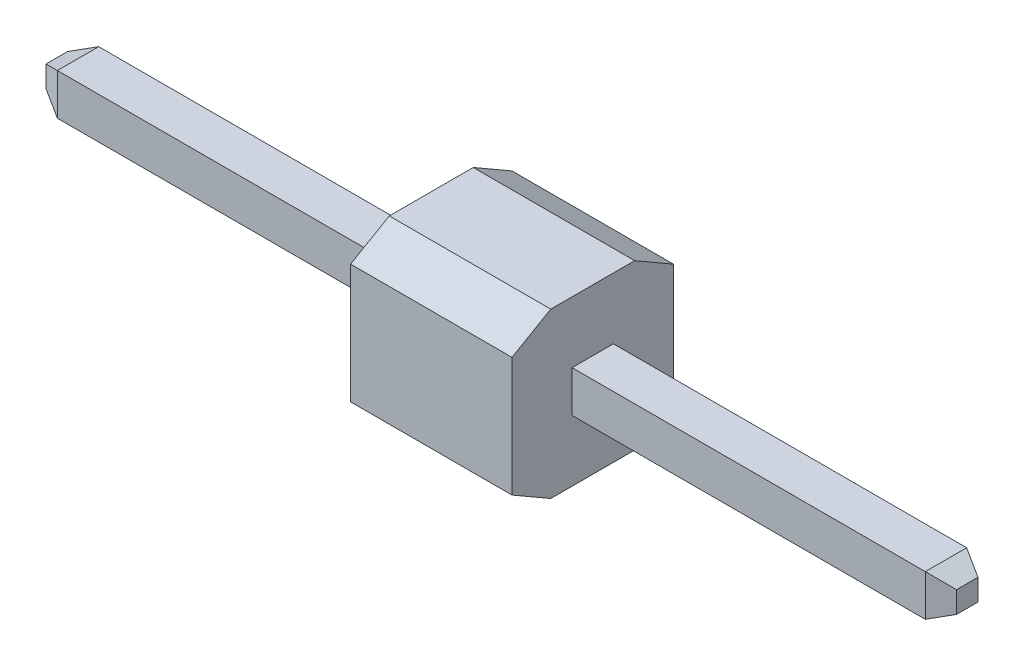
ISO-10303-21;
HEADER;
FILE_DESCRIPTION(('STEP AP214'),'2;1');
FILE_NAME('part.step','',(''),(''),'','','');
FILE_SCHEMA(('AUTOMOTIVE_DESIGN { 1 0 10303 214 1 1 1 1 }'));
ENDSEC;
DATA;
#1=APPLICATION_CONTEXT('core data for automotive mechanical design processes');
#2=APPLICATION_PROTOCOL_DEFINITION('international standard','automotive_design',2000,#1);
#3=PRODUCT_CONTEXT('',#1,'mechanical');
#4=PRODUCT('Part','Part','',(#3));
#5=PRODUCT_RELATED_PRODUCT_CATEGORY('part','',(#4));
#6=PRODUCT_DEFINITION_FORMATION('','',#4);
#7=PRODUCT_DEFINITION_CONTEXT('part definition',#1,'design');
#8=PRODUCT_DEFINITION('design','',#6,#7);
#9=PRODUCT_DEFINITION_SHAPE('','',#8);
#10=(LENGTH_UNIT() NAMED_UNIT(*) SI_UNIT(.MILLI.,.METRE.));
#11=(NAMED_UNIT(*) PLANE_ANGLE_UNIT() SI_UNIT($,.RADIAN.));
#12=(NAMED_UNIT(*) SI_UNIT($,.STERADIAN.) SOLID_ANGLE_UNIT());
#13=UNCERTAINTY_MEASURE_WITH_UNIT(LENGTH_MEASURE(1.E-05),#10,'distance_accuracy_value','');
#14=(GEOMETRIC_REPRESENTATION_CONTEXT(3) GLOBAL_UNCERTAINTY_ASSIGNED_CONTEXT((#13)) GLOBAL_UNIT_ASSIGNED_CONTEXT((#10,
#11,#12)) REPRESENTATION_CONTEXT('',''));
#15=CARTESIAN_POINT('',(0.,0.,0.));
#16=DIRECTION('',(0.,0.,1.));
#17=DIRECTION('',(1.,0.,0.));
#18=AXIS2_PLACEMENT_3D('',#15,#16,#17);
#19=CARTESIAN_POINT('',(5.42104959487915,-12.382878551897,-2.6299971441395));
#20=DIRECTION('',(1.,-9.93476518829084E-08,4.37113882867379E-08));
#21=DIRECTION('',(-9.93476589883358E-08,-1.,8.74227765734759E-08));
#22=AXIS2_PLACEMENT_3D('',#19,#20,#21);
#23=PLANE('',#22);
#24=DIRECTION('',(-1.18186632778994E-08,-0.500000075710538,-0.866025360072935));
#25=VECTOR('',#24,1.);
#26=CARTESIAN_POINT('',(5.42104940270454,-13.6264682531292,-1.05999703542142));
#27=LINE('',#26,#25);
#28=CARTESIAN_POINT('',(5.42104940270454,-13.6264682531292,-1.05999703542142));
#29=VERTEX_POINT('',#28);
#30=CARTESIAN_POINT('',(5.42104939451633,-13.9728784670969,-1.65999700513728));
#31=VERTEX_POINT('',#30);
#32=EDGE_CURVE('E11',#29,#31,#27,.T.);
#33=ORIENTED_EDGE('',*,*,#32,.T.);
#34=DIRECTION('',(4.37113811813104E-08,-8.74227828590458E-08,-0.999999999999995));
#35=VECTOR('',#34,1.);
#36=CARTESIAN_POINT('',(5.42104939451633,-13.9728784670969,-1.65999700513728));
#37=LINE('',#36,#35);
#38=CARTESIAN_POINT('',(5.42104945134113,-13.9728785807465,-2.95999700513728));
#39=VERTEX_POINT('',#38);
#40=EDGE_CURVE('E304',#31,#39,#37,.T.);
#41=ORIENTED_EDGE('',*,*,#40,.T.);
#42=DIRECTION('',(8.75289963529269E-08,0.499999924289835,-0.866025447495714));
#43=VECTOR('',#42,1.);
#44=CARTESIAN_POINT('',(5.42104945134113,-13.9728785807465,-2.95999700513728));
#45=LINE('',#44,#43);
#46=CARTESIAN_POINT('',(5.421049511983,-13.6264684716862,-3.55999703542142));
#47=VERTEX_POINT('',#46);
#48=EDGE_CURVE('E296',#39,#47,#45,.T.);
#49=ORIENTED_EDGE('',*,*,#48,.T.);
#50=DIRECTION('',(9.93476593243698E-08,0.999999999999991,-8.74227764821842E-08));
#51=VECTOR('',#50,1.);
#52=CARTESIAN_POINT('',(5.421049511983,-13.6264684716862,-3.55999703542142));
#53=LINE('',#52,#51);
#54=CARTESIAN_POINT('',(5.42104969549597,-11.7792887947141,-3.559997196907));
#55=VERTEX_POINT('',#54);
#56=EDGE_CURVE('E281',#47,#55,#53,.T.);
#57=ORIENTED_EDGE('',*,*,#56,.T.);
#58=DIRECTION('',(-1.18186632778994E-08,-0.500000075710538,-0.866025360072935));
#59=VECTOR('',#58,1.);
#60=CARTESIAN_POINT('',(5.42104970368418,-11.4328785807465,-2.95999722719114));
#61=LINE('',#60,#59);
#62=CARTESIAN_POINT('',(5.42104970368418,-11.4328785807465,-2.95999722719114));
#63=VERTEX_POINT('',#62);
#64=EDGE_CURVE('E265',#63,#55,#61,.T.);
#65=ORIENTED_EDGE('',*,*,#64,.F.);
#66=DIRECTION('',(4.37113811813104E-08,-8.74227842254741E-08,-0.999999999999995));
#67=VECTOR('',#66,1.);
#68=CARTESIAN_POINT('',(5.42104964685939,-11.4328784670969,-1.65999722719114));
#69=LINE('',#68,#67);
#70=CARTESIAN_POINT('',(5.42104964685939,-11.4328784670969,-1.65999722719114));
#71=VERTEX_POINT('',#70);
#72=EDGE_CURVE('E248',#71,#63,#69,.T.);
#73=ORIENTED_EDGE('',*,*,#72,.F.);
#74=DIRECTION('',(8.75289963529269E-08,0.499999924289835,-0.866025447495714));
#75=VECTOR('',#74,1.);
#76=CARTESIAN_POINT('',(5.42104958621752,-11.7792885761572,-1.059997196907));
#77=LINE('',#76,#75);
#78=CARTESIAN_POINT('',(5.42104958621752,-11.7792885761572,-1.059997196907));
#79=VERTEX_POINT('',#78);
#80=EDGE_CURVE('E242',#79,#71,#77,.T.);
#81=ORIENTED_EDGE('',*,*,#80,.F.);
#82=DIRECTION('',(9.93476593243698E-08,0.999999999999991,-8.74227762417695E-08));
#83=VECTOR('',#82,1.);
#84=CARTESIAN_POINT('',(5.42104940270454,-13.6264682531292,-1.05999703542142));
#85=LINE('',#84,#83);
#86=EDGE_CURVE('E236',#29,#79,#85,.T.);
#87=ORIENTED_EDGE('',*,*,#86,.F.);
#88=EDGE_LOOP('',(#33,#41,#49,#57,#65,#73,#81,#87));
#89=FACE_BOUND('',#88,.T.);
#90=DIRECTION('',(-4.37113803486431E-08,8.74227856773042E-08,0.999999999999995));
#91=VECTOR('',#90,1.);
#92=CARTESIAN_POINT('',(5.42104953129665,-13.022878551897,-2.62999708818892));
#93=LINE('',#92,#91);
#94=CARTESIAN_POINT('',(5.42104953129665,-13.022878551897,-2.62999708818892));
#95=VERTEX_POINT('',#94);
#96=CARTESIAN_POINT('',(5.42104950332137,-13.0228784959464,-1.98999708818892));
#97=VERTEX_POINT('',#96);
#98=EDGE_CURVE('E302',#95,#97,#93,.T.);
#99=ORIENTED_EDGE('',*,*,#98,.T.);
#100=DIRECTION('',(-9.93476578781121E-08,-0.999999999999991,8.7422776656742E-08));
#101=VECTOR('',#100,1.);
#102=CARTESIAN_POINT('',(5.42104956690387,-12.3828784959464,-1.9899971441395));
#103=LINE('',#102,#101);
#104=CARTESIAN_POINT('',(5.42104956690387,-12.3828784959464,-1.9899971441395));
#105=VERTEX_POINT('',#104);
#106=EDGE_CURVE('E293',#105,#97,#103,.T.);
#107=ORIENTED_EDGE('',*,*,#106,.F.);
#108=DIRECTION('',(-4.37113817364219E-08,8.74227829017466E-08,0.999999999999995));
#109=VECTOR('',#108,1.);
#110=CARTESIAN_POINT('',(5.42104959487915,-12.382878551897,-2.6299971441395));
#111=LINE('',#110,#109);
#112=CARTESIAN_POINT('',(5.42104959487915,-12.382878551897,-2.6299971441395));
#113=VERTEX_POINT('',#112);
#114=EDGE_CURVE('E278',#113,#105,#111,.T.);
#115=ORIENTED_EDGE('',*,*,#114,.F.);
#116=DIRECTION('',(-9.93476592658906E-08,-0.999999999999991,8.74227766567418E-08));
#117=VECTOR('',#116,1.);
#118=CARTESIAN_POINT('',(5.42104959487915,-12.382878551897,-2.6299971441395));
#119=LINE('',#118,#117);
#120=EDGE_CURVE('E263',#113,#95,#119,.T.);
#121=ORIENTED_EDGE('',*,*,#120,.T.);
#122=EDGE_LOOP('',(#99,#107,#115,#121));
#123=FACE_BOUND('',#122,.T.);
#124=ADVANCED_FACE('F17',(#89,#123),#23,.T.);
#125=CARTESIAN_POINT('',(2.92104959487915,-12.3828783035278,-2.62999725341797));
#126=DIRECTION('',(1.,-9.93476518829084E-08,4.37113882867379E-08));
#127=DIRECTION('',(-9.93476589883358E-08,-1.,8.74227765734759E-08));
#128=AXIS2_PLACEMENT_3D('',#125,#126,#127);
#129=PLANE('',#128);
#130=DIRECTION('',(-1.18186626369119E-08,-0.500000075710538,-0.866025360072935));
#131=VECTOR('',#130,1.);
#132=CARTESIAN_POINT('',(2.92104940270454,-13.6264680047601,-1.05999714469989));
#133=LINE('',#132,#131);
#134=CARTESIAN_POINT('',(2.92104940270454,-13.6264680047601,-1.05999714469989));
#135=VERTEX_POINT('',#134);
#136=CARTESIAN_POINT('',(2.92104939451633,-13.9728782187277,-1.65999711441575));
#137=VERTEX_POINT('',#136);
#138=EDGE_CURVE('E24',#135,#137,#133,.T.);
#139=ORIENTED_EDGE('',*,*,#138,.F.);
#140=DIRECTION('',(9.9347659083955E-08,0.999999999999991,-8.74227762417695E-08));
#141=VECTOR('',#140,1.);
#142=CARTESIAN_POINT('',(2.92104940270454,-13.6264680047601,-1.05999714469989));
#143=LINE('',#142,#141);
#144=CARTESIAN_POINT('',(2.92104958621752,-11.7792883277881,-1.05999730618547));
#145=VERTEX_POINT('',#144);
#146=EDGE_CURVE('E300',#135,#145,#143,.T.);
#147=ORIENTED_EDGE('',*,*,#146,.T.);
#148=DIRECTION('',(8.75289957119393E-08,0.499999924289835,-0.866025447495714));
#149=VECTOR('',#148,1.);
#150=CARTESIAN_POINT('',(2.92104958621752,-11.7792883277881,-1.05999730618547));
#151=LINE('',#150,#149);
#152=CARTESIAN_POINT('',(2.92104964685939,-11.4328782187277,-1.65999733646961));
#153=VERTEX_POINT('',#152);
#154=EDGE_CURVE('E286',#145,#153,#151,.T.);
#155=ORIENTED_EDGE('',*,*,#154,.T.);
#156=DIRECTION('',(4.37113811813104E-08,-8.74227842254741E-08,-0.999999999999995));
#157=VECTOR('',#156,1.);
#158=CARTESIAN_POINT('',(2.92104964685939,-11.4328782187277,-1.65999733646961));
#159=LINE('',#158,#157);
#160=CARTESIAN_POINT('',(2.92104970368418,-11.4328783323774,-2.95999733646961));
#161=VERTEX_POINT('',#160);
#162=EDGE_CURVE('E271',#153,#161,#159,.T.);
#163=ORIENTED_EDGE('',*,*,#162,.T.);
#164=DIRECTION('',(-1.18186626369119E-08,-0.500000075710538,-0.866025360072935));
#165=VECTOR('',#164,1.);
#166=CARTESIAN_POINT('',(2.92104970368418,-11.4328783323774,-2.95999733646961));
#167=LINE('',#166,#165);
#168=CARTESIAN_POINT('',(2.92104969549597,-11.779288546345,-3.55999730618547));
#169=VERTEX_POINT('',#168);
#170=EDGE_CURVE('E253',#161,#169,#167,.T.);
#171=ORIENTED_EDGE('',*,*,#170,.T.);
#172=DIRECTION('',(9.9347659083955E-08,0.999999999999991,-8.74227764821842E-08));
#173=VECTOR('',#172,1.);
#174=CARTESIAN_POINT('',(2.921049511983,-13.626468223317,-3.55999714469989));
#175=LINE('',#174,#173);
#176=CARTESIAN_POINT('',(2.921049511983,-13.626468223317,-3.55999714469989));
#177=VERTEX_POINT('',#176);
#178=EDGE_CURVE('E261',#177,#169,#175,.T.);
#179=ORIENTED_EDGE('',*,*,#178,.F.);
#180=DIRECTION('',(8.75289957119394E-08,0.499999924289835,-0.866025447495714));
#181=VECTOR('',#180,1.);
#182=CARTESIAN_POINT('',(2.92104945134113,-13.9728783323774,-2.95999711441575));
#183=LINE('',#182,#181);
#184=CARTESIAN_POINT('',(2.92104945134113,-13.9728783323774,-2.95999711441575));
#185=VERTEX_POINT('',#184);
#186=EDGE_CURVE('E276',#185,#177,#183,.T.);
#187=ORIENTED_EDGE('',*,*,#186,.F.);
#188=DIRECTION('',(4.37113811813104E-08,-8.74227828590458E-08,-0.999999999999995));
#189=VECTOR('',#188,1.);
#190=CARTESIAN_POINT('',(2.92104939451633,-13.9728782187277,-1.65999711441575));
#191=LINE('',#190,#189);
#192=EDGE_CURVE('E291',#137,#185,#191,.T.);
#193=ORIENTED_EDGE('',*,*,#192,.F.);
#194=EDGE_LOOP('',(#139,#147,#155,#163,#171,#179,#187,#193));
#195=FACE_BOUND('',#194,.T.);
#196=DIRECTION('',(-9.93476592658908E-08,-0.999999999999991,8.7422776656742E-08));
#197=VECTOR('',#196,1.);
#198=CARTESIAN_POINT('',(2.92104956690387,-12.3828782475773,-1.98999725341797));
#199=LINE('',#198,#197);
#200=CARTESIAN_POINT('',(2.92104956690387,-12.3828782475773,-1.98999725341797));
#201=VERTEX_POINT('',#200);
#202=CARTESIAN_POINT('',(2.92104950332136,-13.0228782475773,-1.98999719746739));
#203=VERTEX_POINT('',#202);
#204=EDGE_CURVE('E298',#201,#203,#199,.T.);
#205=ORIENTED_EDGE('',*,*,#204,.T.);
#206=DIRECTION('',(-4.37113810425325E-08,8.74227856773042E-08,0.999999999999995));
#207=VECTOR('',#206,1.);
#208=CARTESIAN_POINT('',(2.92104953129665,-13.0228783035278,-2.62999719746739));
#209=LINE('',#208,#207);
#210=CARTESIAN_POINT('',(2.92104953129665,-13.0228783035278,-2.62999719746739));
#211=VERTEX_POINT('',#210);
#212=EDGE_CURVE('E283',#211,#203,#209,.T.);
#213=ORIENTED_EDGE('',*,*,#212,.F.);
#214=DIRECTION('',(-9.93476592658906E-08,-0.999999999999991,8.74227766567418E-08));
#215=VECTOR('',#214,1.);
#216=CARTESIAN_POINT('',(2.92104959487915,-12.3828783035278,-2.62999725341797));
#217=LINE('',#216,#215);
#218=CARTESIAN_POINT('',(2.92104959487915,-12.3828783035278,-2.62999725341797));
#219=VERTEX_POINT('',#218);
#220=EDGE_CURVE('E268',#219,#211,#217,.T.);
#221=ORIENTED_EDGE('',*,*,#220,.F.);
#222=DIRECTION('',(-4.37113810425325E-08,8.74227829017466E-08,0.999999999999995));
#223=VECTOR('',#222,1.);
#224=CARTESIAN_POINT('',(2.92104959487915,-12.3828783035278,-2.62999725341797));
#225=LINE('',#224,#223);
#226=EDGE_CURVE('E251',#219,#201,#225,.T.);
#227=ORIENTED_EDGE('',*,*,#226,.T.);
#228=EDGE_LOOP('',(#205,#213,#221,#227));
#229=FACE_BOUND('',#228,.T.);
#230=ADVANCED_FACE('F314',(#195,#229),#129,.F.);
#231=CARTESIAN_POINT('',(5.42104940270454,-13.6264682531292,-1.05999703542142));
#232=DIRECTION('',(1.07893287081065E-07,0.866025360072937,-0.500000075710535));
#233=DIRECTION('',(1.18186629566715E-08,0.500000075710542,0.866025360072941));
#234=AXIS2_PLACEMENT_3D('',#231,#232,#233);
#235=PLANE('',#234);
#236=ORIENTED_EDGE('',*,*,#138,.T.);
#237=DIRECTION('',(-0.999999999999994,9.93476518829078E-08,-4.37113884643734E-08));
#238=VECTOR('',#237,1.);
#239=CARTESIAN_POINT('',(5.42104939451633,-13.9728784670969,-1.65999700513728));
#240=LINE('',#239,#238);
#241=EDGE_CURVE('E288',#31,#137,#240,.T.);
#242=ORIENTED_EDGE('',*,*,#241,.F.);
#243=ORIENTED_EDGE('',*,*,#32,.F.);
#244=DIRECTION('',(-0.999999999999994,9.93476518829078E-08,-4.3711388109102E-08));
#245=VECTOR('',#244,1.);
#246=CARTESIAN_POINT('',(5.42104940270454,-13.6264682531292,-1.05999703542142));
#247=LINE('',#246,#245);
#248=EDGE_CURVE('E256',#29,#135,#247,.T.);
#249=ORIENTED_EDGE('',*,*,#248,.T.);
#250=EDGE_LOOP('',(#236,#242,#243,#249));
#251=FACE_BOUND('',#250,.T.);
#252=ADVANCED_FACE('F306',(#251),#235,.F.);
#253=CARTESIAN_POINT('',(5.42104939451633,-13.9728784670969,-1.65999700513728));
#254=DIRECTION('',(9.93476589883358E-08,1.,-8.74227765734759E-08));
#255=DIRECTION('',(1.,-9.93476518829084E-08,4.37113882867379E-08));
#256=AXIS2_PLACEMENT_3D('',#253,#254,#255);
#257=PLANE('',#256);
#258=ORIENTED_EDGE('',*,*,#192,.T.);
#259=DIRECTION('',(-0.999999999999994,9.93476518829078E-08,-4.37113882867377E-08));
#260=VECTOR('',#259,1.);
#261=CARTESIAN_POINT('',(5.42104945134113,-13.9728785807465,-2.95999700513728));
#262=LINE('',#261,#260);
#263=EDGE_CURVE('E273',#39,#185,#262,.T.);
#264=ORIENTED_EDGE('',*,*,#263,.F.);
#265=ORIENTED_EDGE('',*,*,#40,.F.);
#266=ORIENTED_EDGE('',*,*,#241,.T.);
#267=EDGE_LOOP('',(#258,#264,#265,#266));
#268=FACE_BOUND('',#267,.T.);
#269=ADVANCED_FACE('F311',(#268),#257,.F.);
#270=CARTESIAN_POINT('',(5.42104945134113,-13.9728785807465,-2.95999700513728));
#271=DIRECTION('',(6.41819058997377E-08,0.866025447495721,0.499999924289845));
#272=DIRECTION('',(-8.7528996031702E-08,-0.499999924289838,0.866025447495717));
#273=AXIS2_PLACEMENT_3D('',#270,#271,#272);
#274=PLANE('',#273);
#275=ORIENTED_EDGE('',*,*,#186,.T.);
#276=DIRECTION('',(-0.999999999999994,9.93476518829078E-08,-4.37113882867377E-08));
#277=VECTOR('',#276,1.);
#278=CARTESIAN_POINT('',(5.421049511983,-13.6264684716862,-3.55999703542142));
#279=LINE('',#278,#277);
#280=EDGE_CURVE('E258',#47,#177,#279,.T.);
#281=ORIENTED_EDGE('',*,*,#280,.F.);
#282=ORIENTED_EDGE('',*,*,#48,.F.);
#283=ORIENTED_EDGE('',*,*,#263,.T.);
#284=EDGE_LOOP('',(#275,#281,#282,#283));
#285=FACE_BOUND('',#284,.T.);
#286=ADVANCED_FACE('F319',(#285),#274,.F.);
#287=CARTESIAN_POINT('',(5.421049511983,-13.6264684716862,-3.55999703542142));
#288=DIRECTION('',(-4.37113811813106E-08,8.74227836789032E-08,1.));
#289=DIRECTION('',(-1.,9.93476518829084E-08,-4.37113882867379E-08));
#290=AXIS2_PLACEMENT_3D('',#287,#288,#289);
#291=PLANE('',#290);
#292=ORIENTED_EDGE('',*,*,#178,.T.);
#293=DIRECTION('',(-0.999999999999994,9.93476518829078E-08,-4.37113884643734E-08));
#294=VECTOR('',#293,1.);
#295=CARTESIAN_POINT('',(5.42104969549597,-11.7792887947141,-3.559997196907));
#296=LINE('',#295,#294);
#297=EDGE_CURVE('E245',#55,#169,#296,.T.);
#298=ORIENTED_EDGE('',*,*,#297,.F.);
#299=ORIENTED_EDGE('',*,*,#56,.F.);
#300=ORIENTED_EDGE('',*,*,#280,.T.);
#301=EDGE_LOOP('',(#292,#298,#299,#300));
#302=FACE_BOUND('',#301,.T.);
#303=ADVANCED_FACE('F326',(#302),#291,.F.);
#304=CARTESIAN_POINT('',(5.42104970368418,-11.4328785807465,-2.95999722719114));
#305=DIRECTION('',(1.07893287081065E-07,0.866025360072937,-0.500000075710535));
#306=DIRECTION('',(1.18186629566715E-08,0.500000075710542,0.866025360072941));
#307=AXIS2_PLACEMENT_3D('',#304,#305,#306);
#308=PLANE('',#307);
#309=ORIENTED_EDGE('',*,*,#170,.F.);
#310=DIRECTION('',(-0.999999999999994,9.93476518829078E-08,-4.37113882867377E-08));
#311=VECTOR('',#310,1.);
#312=CARTESIAN_POINT('',(5.42104970368418,-11.4328785807465,-2.95999722719114));
#313=LINE('',#312,#311);
#314=EDGE_CURVE('E239',#63,#161,#313,.T.);
#315=ORIENTED_EDGE('',*,*,#314,.F.);
#316=ORIENTED_EDGE('',*,*,#64,.T.);
#317=ORIENTED_EDGE('',*,*,#297,.T.);
#318=EDGE_LOOP('',(#309,#315,#316,#317));
#319=FACE_BOUND('',#318,.T.);
#320=ADVANCED_FACE('F329',(#319),#308,.T.);
#321=CARTESIAN_POINT('',(5.42104964685939,-11.4328784670969,-1.65999722719114));
#322=DIRECTION('',(9.93476589883358E-08,1.,-8.74227765734759E-08));
#323=DIRECTION('',(1.,-9.93476518829084E-08,4.37113882867379E-08));
#324=AXIS2_PLACEMENT_3D('',#321,#322,#323);
#325=PLANE('',#324);
#326=ORIENTED_EDGE('',*,*,#162,.F.);
#327=DIRECTION('',(-0.999999999999994,9.93476518829078E-08,-4.37113883755555E-08));
#328=VECTOR('',#327,1.);
#329=CARTESIAN_POINT('',(5.42104964685939,-11.4328784670969,-1.65999722719114));
#330=LINE('',#329,#328);
#331=EDGE_CURVE('E233',#71,#153,#330,.T.);
#332=ORIENTED_EDGE('',*,*,#331,.F.);
#333=ORIENTED_EDGE('',*,*,#72,.T.);
#334=ORIENTED_EDGE('',*,*,#314,.T.);
#335=EDGE_LOOP('',(#326,#332,#333,#334));
#336=FACE_BOUND('',#335,.T.);
#337=ADVANCED_FACE('F333',(#336),#325,.T.);
#338=CARTESIAN_POINT('',(5.42104958621752,-11.7792885761572,-1.059997196907));
#339=DIRECTION('',(6.41819058997377E-08,0.866025447495721,0.499999924289845));
#340=DIRECTION('',(-8.7528996031702E-08,-0.499999924289838,0.866025447495717));
#341=AXIS2_PLACEMENT_3D('',#338,#339,#340);
#342=PLANE('',#341);
#343=ORIENTED_EDGE('',*,*,#154,.F.);
#344=DIRECTION('',(-0.999999999999994,9.93476518829078E-08,-4.3711388109102E-08));
#345=VECTOR('',#344,1.);
#346=CARTESIAN_POINT('',(5.42104958621752,-11.7792885761572,-1.059997196907));
#347=LINE('',#346,#345);
#348=EDGE_CURVE('E230',#79,#145,#347,.T.);
#349=ORIENTED_EDGE('',*,*,#348,.F.);
#350=ORIENTED_EDGE('',*,*,#80,.T.);
#351=ORIENTED_EDGE('',*,*,#331,.T.);
#352=EDGE_LOOP('',(#343,#349,#350,#351));
#353=FACE_BOUND('',#352,.T.);
#354=ADVANCED_FACE('F337',(#353),#342,.T.);
#355=CARTESIAN_POINT('',(5.42104940270454,-13.6264682531292,-1.05999703542142));
#356=DIRECTION('',(-4.37113811813106E-08,8.74227835615132E-08,1.));
#357=DIRECTION('',(-9.93476589883358E-08,-1.,8.74227764560859E-08));
#358=AXIS2_PLACEMENT_3D('',#355,#356,#357);
#359=PLANE('',#358);
#360=ORIENTED_EDGE('',*,*,#146,.F.);
#361=ORIENTED_EDGE('',*,*,#248,.F.);
#362=ORIENTED_EDGE('',*,*,#86,.T.);
#363=ORIENTED_EDGE('',*,*,#348,.T.);
#364=EDGE_LOOP('',(#360,#361,#362,#363));
#365=FACE_BOUND('',#364,.T.);
#366=ADVANCED_FACE('F339',(#365),#359,.T.);
#367=CARTESIAN_POINT('',(-2.87895040512085,-12.3828777273115,-2.62999750694402));
#368=DIRECTION('',(-1.,9.93476518829084E-08,-4.37113882867379E-08));
#369=DIRECTION('',(9.93476589883358E-08,1.,-8.74227765734759E-08));
#370=AXIS2_PLACEMENT_3D('',#367,#368,#369);
#371=PLANE('',#370);
#372=DIRECTION('',(9.9347663492056E-08,0.999999999999991,-8.74227774760709E-08));
#373=VECTOR('',#372,1.);
#374=CARTESIAN_POINT('',(-2.87895047466449,-12.8689961576226,-2.14387899163719));
#375=LINE('',#374,#373);
#376=CARTESIAN_POINT('',(-2.87895047466449,-12.8689961576226,-2.14387899163719));
#377=VERTEX_POINT('',#376);
#378=CARTESIAN_POINT('',(-2.87895044165753,-12.5367592120046,-2.14387902068227));
#379=VERTEX_POINT('',#378);
#380=EDGE_CURVE('E228',#377,#379,#375,.T.);
#381=ORIENTED_EDGE('',*,*,#380,.T.);
#382=DIRECTION('',(4.37113820547149E-08,-8.74227801493995E-08,-0.999999999999995));
#383=VECTOR('',#382,1.);
#384=CARTESIAN_POINT('',(-2.87895044165753,-12.5367592120046,-2.14387902068227));
#385=LINE('',#384,#383);
#386=CARTESIAN_POINT('',(-2.87895042713499,-12.5367592410497,-2.47611596630027));
#387=VERTEX_POINT('',#386);
#388=EDGE_CURVE('E223',#379,#387,#385,.T.);
#389=ORIENTED_EDGE('',*,*,#388,.T.);
#390=DIRECTION('',(-9.93476554720712E-08,-0.999999999999991,8.74227761394067E-08));
#391=VECTOR('',#390,1.);
#392=CARTESIAN_POINT('',(-2.87895042713499,-12.5367592410497,-2.47611596630027));
#393=LINE('',#392,#391);
#394=CARTESIAN_POINT('',(-2.87895046014196,-12.8689961866677,-2.47611593725519));
#395=VERTEX_POINT('',#394);
#396=EDGE_CURVE('E215',#387,#395,#393,.T.);
#397=ORIENTED_EDGE('',*,*,#396,.T.);
#398=DIRECTION('',(-4.37113740347301E-08,8.74227801493995E-08,0.999999999999995));
#399=VECTOR('',#398,1.);
#400=CARTESIAN_POINT('',(-2.87895046014196,-12.8689961866677,-2.47611593725519));
#401=LINE('',#400,#399);
#402=EDGE_CURVE('E207',#395,#377,#401,.T.);
#403=ORIENTED_EDGE('',*,*,#402,.T.);
#404=EDGE_LOOP('',(#381,#389,#397,#403));
#405=FACE_BOUND('',#404,.T.);
#406=ADVANCED_FACE('F341',(#405),#371,.T.);
#407=CARTESIAN_POINT('',(-2.87895040512085,-12.3828777273115,-2.62999750694402));
#408=DIRECTION('',(9.93476589883358E-08,1.,-8.74227764510112E-08));
#409=DIRECTION('',(-4.37113811813106E-08,8.74227835564385E-08,1.));
#410=AXIS2_PLACEMENT_3D('',#407,#408,#409);
#411=PLANE('',#410);
#412=DIRECTION('',(0.999999999999994,-9.93476517789893E-08,4.37113882769953E-08));
#413=VECTOR('',#412,1.);
#414=CARTESIAN_POINT('',(-2.54895040512085,-12.3828777600962,-2.62999749251926));
#415=LINE('',#414,#413);
#416=CARTESIAN_POINT('',(-2.54895040512085,-12.3828777600962,-2.62999749251926));
#417=VERTEX_POINT('',#416);
#418=EDGE_CURVE('E225',#417,#219,#415,.T.);
#419=ORIENTED_EDGE('',*,*,#418,.F.);
#420=DIRECTION('',(-4.37113817364219E-08,8.74227856773042E-08,0.999999999999995));
#421=VECTOR('',#420,1.);
#422=CARTESIAN_POINT('',(-2.54895040512085,-12.3828777600962,-2.62999749251926));
#423=LINE('',#422,#421);
#424=CARTESIAN_POINT('',(-2.54895043309613,-12.3828777041456,-1.98999749251926));
#425=VERTEX_POINT('',#424);
#426=EDGE_CURVE('E217',#417,#425,#423,.T.);
#427=ORIENTED_EDGE('',*,*,#426,.T.);
#428=DIRECTION('',(0.999999999999994,-9.93476521037346E-08,4.3711388195809E-08));
#429=VECTOR('',#428,1.);
#430=CARTESIAN_POINT('',(-2.54895043309613,-12.3828777041456,-1.98999749251926));
#431=LINE('',#430,#429);
#432=EDGE_CURVE('E220',#425,#201,#431,.T.);
#433=ORIENTED_EDGE('',*,*,#432,.T.);
#434=ORIENTED_EDGE('',*,*,#226,.F.);
#435=EDGE_LOOP('',(#419,#427,#433,#434));
#436=FACE_BOUND('',#435,.T.);
#437=ADVANCED_FACE('F348',(#436),#411,.T.);
#438=CARTESIAN_POINT('',(-2.87895043309613,-12.3828776713609,-1.98999750694402));
#439=DIRECTION('',(-4.37113811813106E-08,8.74227836789032E-08,1.));
#440=DIRECTION('',(-1.,9.93476518829084E-08,-4.37113882867379E-08));
#441=AXIS2_PLACEMENT_3D('',#438,#439,#440);
#442=PLANE('',#441);
#443=ORIENTED_EDGE('',*,*,#432,.F.);
#444=DIRECTION('',(-9.93476578781118E-08,-0.999999999999991,8.74227766567418E-08));
#445=VECTOR('',#444,1.);
#446=CARTESIAN_POINT('',(-2.54895043309613,-12.3828777041456,-1.98999749251926));
#447=LINE('',#446,#445);
#448=CARTESIAN_POINT('',(-2.54895049667863,-13.0228777041456,-1.98999743656869));
#449=VERTEX_POINT('',#448);
#450=EDGE_CURVE('E209',#425,#449,#447,.T.);
#451=ORIENTED_EDGE('',*,*,#450,.T.);
#452=DIRECTION('',(0.999999999999994,-9.93476517789893E-08,4.3711388195809E-08));
#453=VECTOR('',#452,1.);
#454=CARTESIAN_POINT('',(-2.54895049667863,-13.0228777041456,-1.98999743656869));
#455=LINE('',#454,#453);
#456=EDGE_CURVE('E212',#449,#203,#455,.T.);
#457=ORIENTED_EDGE('',*,*,#456,.T.);
#458=ORIENTED_EDGE('',*,*,#204,.F.);
#459=EDGE_LOOP('',(#443,#451,#457,#458));
#460=FACE_BOUND('',#459,.T.);
#461=ADVANCED_FACE('F424',(#460),#442,.T.);
#462=CARTESIAN_POINT('',(-2.87895046870335,-13.0228777273115,-2.62999745099344));
#463=DIRECTION('',(9.93476589883357E-08,1.,-8.74227764040693E-08));
#464=DIRECTION('',(-4.37113811813106E-08,8.74227835094966E-08,1.));
#465=AXIS2_PLACEMENT_3D('',#462,#463,#464);
#466=PLANE('',#465);
#467=ORIENTED_EDGE('',*,*,#456,.F.);
#468=DIRECTION('',(4.37113817364219E-08,-8.74227829017466E-08,-0.999999999999995));
#469=VECTOR('',#468,1.);
#470=CARTESIAN_POINT('',(-2.54895049667864,-13.0228777041456,-1.98999743656869));
#471=LINE('',#470,#469);
#472=CARTESIAN_POINT('',(-2.54895046870335,-13.0228777600962,-2.62999743656869));
#473=VERTEX_POINT('',#472);
#474=EDGE_CURVE('E201',#449,#473,#471,.T.);
#475=ORIENTED_EDGE('',*,*,#474,.T.);
#476=DIRECTION('',(0.999999999999994,-9.93476521037346E-08,4.37113882769953E-08));
#477=VECTOR('',#476,1.);
#478=CARTESIAN_POINT('',(-2.54895046870335,-13.0228777600962,-2.62999743656869));
#479=LINE('',#478,#477);
#480=EDGE_CURVE('E204',#473,#211,#479,.T.);
#481=ORIENTED_EDGE('',*,*,#480,.T.);
#482=ORIENTED_EDGE('',*,*,#212,.T.);
#483=EDGE_LOOP('',(#467,#475,#481,#482));
#484=FACE_BOUND('',#483,.T.);
#485=ADVANCED_FACE('F421',(#484),#466,.F.);
#486=CARTESIAN_POINT('',(-2.87895040512085,-12.3828777273115,-2.62999750694402));
#487=DIRECTION('',(-4.37113811813106E-08,8.74227836789032E-08,1.));
#488=DIRECTION('',(-1.,9.93476518829084E-08,-4.37113882867379E-08));
#489=AXIS2_PLACEMENT_3D('',#486,#487,#488);
#490=PLANE('',#489);
#491=ORIENTED_EDGE('',*,*,#480,.F.);
#492=DIRECTION('',(9.93476606536696E-08,0.999999999999991,-8.7422776656742E-08));
#493=VECTOR('',#492,1.);
#494=CARTESIAN_POINT('',(-2.54895046870335,-13.0228777600962,-2.62999743656869));
#495=LINE('',#494,#493);
#496=EDGE_CURVE('E196',#473,#417,#495,.T.);
#497=ORIENTED_EDGE('',*,*,#496,.T.);
#498=ORIENTED_EDGE('',*,*,#418,.T.);
#499=ORIENTED_EDGE('',*,*,#220,.T.);
#500=EDGE_LOOP('',(#491,#497,#498,#499));
#501=FACE_BOUND('',#500,.T.);
#502=ADVANCED_FACE('F376',(#501),#490,.F.);
#503=CARTESIAN_POINT('',(-2.87895040512085,-12.3828777273115,-2.62999750694402));
#504=DIRECTION('',(-4.37113811813106E-08,8.74227836789032E-08,1.));
#505=DIRECTION('',(-1.,9.93476518829084E-08,-4.37113882867379E-08));
#506=AXIS2_PLACEMENT_3D('',#503,#504,#505);
#507=PLANE('',#506);
#508=DIRECTION('',(0.999999999999994,-9.93476517789893E-08,4.37113882769953E-08));
#509=VECTOR('',#508,1.);
#510=CARTESIAN_POINT('',(5.42104959487915,-12.382878551897,-2.6299971441395));
#511=LINE('',#510,#509);
#512=CARTESIAN_POINT('',(10.8910495948791,-12.3828790953286,-2.6299969050382));
#513=VERTEX_POINT('',#512);
#514=EDGE_CURVE('E199',#113,#513,#511,.T.);
#515=ORIENTED_EDGE('',*,*,#514,.T.);
#516=DIRECTION('',(-9.93476578781118E-08,-0.999999999999991,8.74227766567418E-08));
#517=VECTOR('',#516,1.);
#518=CARTESIAN_POINT('',(10.8910495948791,-12.3828790953286,-2.6299969050382));
#519=LINE('',#518,#517);
#520=CARTESIAN_POINT('',(10.8910495312966,-13.0228790953286,-2.62999684908763));
#521=VERTEX_POINT('',#520);
#522=EDGE_CURVE('E191',#513,#521,#519,.T.);
#523=ORIENTED_EDGE('',*,*,#522,.T.);
#524=DIRECTION('',(0.999999999999994,-9.9347651454244E-08,4.37113882769953E-08));
#525=VECTOR('',#524,1.);
#526=CARTESIAN_POINT('',(5.42104953129665,-13.022878551897,-2.62999708818892));
#527=LINE('',#526,#525);
#528=EDGE_CURVE('E194',#95,#521,#527,.T.);
#529=ORIENTED_EDGE('',*,*,#528,.F.);
#530=ORIENTED_EDGE('',*,*,#120,.F.);
#531=EDGE_LOOP('',(#515,#523,#529,#530));
#532=FACE_BOUND('',#531,.T.);
#533=ADVANCED_FACE('F367',(#532),#507,.F.);
#534=CARTESIAN_POINT('',(-2.87895046870335,-13.0228777273115,-2.62999745099344));
#535=DIRECTION('',(9.93476589883357E-08,1.,-8.74227764040693E-08));
#536=DIRECTION('',(-4.37113811813106E-08,8.74227835094966E-08,1.));
#537=AXIS2_PLACEMENT_3D('',#534,#535,#536);
#538=PLANE('',#537);
#539=ORIENTED_EDGE('',*,*,#528,.T.);
#540=DIRECTION('',(-4.37113817364219E-08,8.74227829017466E-08,0.999999999999995));
#541=VECTOR('',#540,1.);
#542=CARTESIAN_POINT('',(10.8910495312966,-13.0228790953286,-2.62999684908763));
#543=LINE('',#542,#541);
#544=CARTESIAN_POINT('',(10.8910495033214,-13.022879039378,-1.98999684908763));
#545=VERTEX_POINT('',#544);
#546=EDGE_CURVE('E186',#521,#545,#543,.T.);
#547=ORIENTED_EDGE('',*,*,#546,.T.);
#548=DIRECTION('',(0.999999999999994,-9.93476517789893E-08,4.37113881146227E-08));
#549=VECTOR('',#548,1.);
#550=CARTESIAN_POINT('',(5.42104950332137,-13.0228784959464,-1.98999708818892));
#551=LINE('',#550,#549);
#552=EDGE_CURVE('E189',#97,#545,#551,.T.);
#553=ORIENTED_EDGE('',*,*,#552,.F.);
#554=ORIENTED_EDGE('',*,*,#98,.F.);
#555=EDGE_LOOP('',(#539,#547,#553,#554));
#556=FACE_BOUND('',#555,.T.);
#557=ADVANCED_FACE('F364',(#556),#538,.F.);
#558=CARTESIAN_POINT('',(-2.87895043309613,-12.3828776713609,-1.98999750694402));
#559=DIRECTION('',(-4.37113811813106E-08,8.74227836789032E-08,1.));
#560=DIRECTION('',(-1.,9.93476518829084E-08,-4.37113882867379E-08));
#561=AXIS2_PLACEMENT_3D('',#558,#559,#560);
#562=PLANE('',#561);
#563=ORIENTED_EDGE('',*,*,#552,.T.);
#564=DIRECTION('',(9.93476578781118E-08,0.999999999999991,-8.74227763097971E-08));
#565=VECTOR('',#564,1.);
#566=CARTESIAN_POINT('',(10.8910495033214,-13.022879039378,-1.98999684908763));
#567=LINE('',#566,#565);
#568=CARTESIAN_POINT('',(10.8910495669039,-12.382879039378,-1.9899969050382));
#569=VERTEX_POINT('',#568);
#570=EDGE_CURVE('E176',#545,#569,#567,.T.);
#571=ORIENTED_EDGE('',*,*,#570,.T.);
#572=DIRECTION('',(0.999999999999994,-9.93476517789893E-08,4.37113881146227E-08));
#573=VECTOR('',#572,1.);
#574=CARTESIAN_POINT('',(5.42104956690387,-12.3828784959464,-1.9899971441395));
#575=LINE('',#574,#573);
#576=EDGE_CURVE('E179',#105,#569,#575,.T.);
#577=ORIENTED_EDGE('',*,*,#576,.F.);
#578=ORIENTED_EDGE('',*,*,#106,.T.);
#579=EDGE_LOOP('',(#563,#571,#577,#578));
#580=FACE_BOUND('',#579,.T.);
#581=ADVANCED_FACE('F366',(#580),#562,.T.);
#582=CARTESIAN_POINT('',(-2.87895040512085,-12.3828777273115,-2.62999750694402));
#583=DIRECTION('',(9.93476589883358E-08,1.,-8.74227764510112E-08));
#584=DIRECTION('',(-4.37113811813106E-08,8.74227835564385E-08,1.));
#585=AXIS2_PLACEMENT_3D('',#582,#583,#584);
#586=PLANE('',#585);
#587=ORIENTED_EDGE('',*,*,#576,.T.);
#588=DIRECTION('',(4.37113789608643E-08,-8.74227829017466E-08,-0.999999999999995));
#589=VECTOR('',#588,1.);
#590=CARTESIAN_POINT('',(10.8910495669039,-12.382879039378,-1.9899969050382));
#591=LINE('',#590,#589);
#592=EDGE_CURVE('E167',#569,#513,#591,.T.);
#593=ORIENTED_EDGE('',*,*,#592,.T.);
#594=ORIENTED_EDGE('',*,*,#514,.F.);
#595=ORIENTED_EDGE('',*,*,#114,.T.);
#596=EDGE_LOOP('',(#587,#593,#594,#595));
#597=FACE_BOUND('',#596,.T.);
#598=ADVANCED_FACE('F373',(#597),#586,.T.);
#599=CARTESIAN_POINT('',(11.2210495948792,-12.3828791281133,-2.62999689061345));
#600=DIRECTION('',(-1.,9.93476518829084E-08,-4.37113882867379E-08));
#601=DIRECTION('',(9.93476589883358E-08,1.,-8.74227765734759E-08));
#602=AXIS2_PLACEMENT_3D('',#599,#600,#601);
#603=PLANE('',#602);
#604=DIRECTION('',(-9.9347663492056E-08,-0.999999999999991,8.74227761394067E-08));
#605=VECTOR('',#604,1.);
#606=CARTESIAN_POINT('',(11.2210495583425,-12.5367606128065,-2.1438784043517));
#607=LINE('',#606,#605);
#608=CARTESIAN_POINT('',(11.2210495583425,-12.5367606128065,-2.1438784043517));
#609=VERTEX_POINT('',#608);
#610=CARTESIAN_POINT('',(11.2210495253355,-12.8689975584245,-2.14387837530662));
#611=VERTEX_POINT('',#610);
#612=EDGE_CURVE('E153',#609,#611,#607,.T.);
#613=ORIENTED_EDGE('',*,*,#612,.T.);
#614=DIRECTION('',(4.37113820547149E-08,-8.74227854960561E-08,-0.999999999999995));
#615=VECTOR('',#614,1.);
#616=CARTESIAN_POINT('',(11.2210495253355,-12.8689975584245,-2.14387837530662));
#617=LINE('',#616,#615);
#618=CARTESIAN_POINT('',(11.221049539858,-12.8689975874696,-2.47611532092462));
#619=VERTEX_POINT('',#618);
#620=EDGE_CURVE('E395',#611,#619,#617,.T.);
#621=ORIENTED_EDGE('',*,*,#620,.T.);
#622=DIRECTION('',(9.93476527987429E-08,0.999999999999991,-8.74227761394067E-08));
#623=VECTOR('',#622,1.);
#624=CARTESIAN_POINT('',(11.221049539858,-12.8689975874696,-2.47611532092462));
#625=LINE('',#624,#623);
#626=CARTESIAN_POINT('',(11.221049572865,-12.5367606418516,-2.4761153499697));
#627=VERTEX_POINT('',#626);
#628=EDGE_CURVE('E156',#619,#627,#625,.T.);
#629=ORIENTED_EDGE('',*,*,#628,.T.);
#630=DIRECTION('',(-4.37113874013715E-08,8.74227854960561E-08,0.999999999999995));
#631=VECTOR('',#630,1.);
#632=CARTESIAN_POINT('',(11.221049572865,-12.5367606418516,-2.4761153499697));
#633=LINE('',#632,#631);
#634=EDGE_CURVE('E149',#627,#609,#633,.T.);
#635=ORIENTED_EDGE('',*,*,#634,.T.);
#636=EDGE_LOOP('',(#613,#621,#629,#635));
#637=FACE_BOUND('',#636,.T.);
#638=ADVANCED_FACE('F151',(#637),#603,.F.);
#639=CARTESIAN_POINT('',(-2.87895045341558,-12.8689962001205,-2.62999746444619));
#640=DIRECTION('',(-0.422618351780369,-0.906307745050466,6.07587120833484E-08));
#641=DIRECTION('',(4.37113811813106E-08,-8.74227835094966E-08,-1.));
#642=AXIS2_PLACEMENT_3D('',#639,#640,#641);
#643=PLANE('',#642);
#644=DIRECTION('',(0.834817073788748,-0.389281669540043,0.389281691158098));
#645=VECTOR('',#644,1.);
#646=CARTESIAN_POINT('',(-2.87895047466418,-12.8689961576223,-2.14387899163752));
#647=LINE('',#646,#645);
#648=EDGE_CURVE('E181',#377,#449,#647,.T.);
#649=ORIENTED_EDGE('',*,*,#648,.F.);
#650=ORIENTED_EDGE('',*,*,#402,.F.);
#651=DIRECTION('',(-0.834817107820822,0.389281737604206,0.389281550111905));
#652=VECTOR('',#651,1.);
#653=CARTESIAN_POINT('',(-2.54895046870313,-13.0228777600959,-2.62999743656845));
#654=LINE('',#653,#652);
#655=EDGE_CURVE('E404',#473,#395,#654,.T.);
#656=ORIENTED_EDGE('',*,*,#655,.F.);
#657=ORIENTED_EDGE('',*,*,#474,.F.);
#658=EDGE_LOOP('',(#649,#650,#656,#657));
#659=FACE_BOUND('',#658,.T.);
#660=ADVANCED_FACE('F418',(#659),#643,.T.);
#661=CARTESIAN_POINT('',(-2.87895041184722,-12.3828777138587,-2.47611597975302));
#662=DIRECTION('',(-0.422618222124847,-3.72458176658199E-08,-0.906307805509828));
#663=DIRECTION('',(9.93476589883358E-08,1.,-8.74227765734759E-08));
#664=AXIS2_PLACEMENT_3D('',#661,#662,#663);
#665=PLANE('',#664);
#666=ORIENTED_EDGE('',*,*,#655,.T.);
#667=ORIENTED_EDGE('',*,*,#396,.F.);
#668=DIRECTION('',(-0.834817185169256,-0.389281503665796,0.389281618176066));
#669=VECTOR('',#668,1.);
#670=CARTESIAN_POINT('',(-2.54895040512068,-12.3828777600964,-2.62999749251908));
#671=LINE('',#670,#669);
#672=EDGE_CURVE('E160',#417,#387,#671,.T.);
#673=ORIENTED_EDGE('',*,*,#672,.F.);
#674=ORIENTED_EDGE('',*,*,#496,.F.);
#675=EDGE_LOOP('',(#666,#667,#673,#674));
#676=FACE_BOUND('',#675,.T.);
#677=ADVANCED_FACE('F434',(#676),#665,.T.);
#678=CARTESIAN_POINT('',(-2.54895043309613,-12.3828777041456,-1.98999749251926));
#679=DIRECTION('',(0.422618301356777,-1.21218081559392E-07,-0.906307768563367));
#680=DIRECTION('',(-9.93476589883358E-08,-1.,8.74227765734759E-08));
#681=AXIS2_PLACEMENT_3D('',#678,#679,#680);
#682=PLANE('',#681);
#683=ORIENTED_EDGE('',*,*,#648,.T.);
#684=ORIENTED_EDGE('',*,*,#450,.F.);
#685=DIRECTION('',(0.834817151137182,0.389281571729962,0.389281623093936));
#686=VECTOR('',#685,1.);
#687=CARTESIAN_POINT('',(-2.87895044165744,-12.5367592120047,-2.14387902068237));
#688=LINE('',#687,#686);
#689=EDGE_CURVE('E170',#379,#425,#688,.T.);
#690=ORIENTED_EDGE('',*,*,#689,.F.);
#691=ORIENTED_EDGE('',*,*,#380,.F.);
#692=EDGE_LOOP('',(#683,#684,#690,#691));
#693=FACE_BOUND('',#692,.T.);
#694=ADVANCED_FACE('F413',(#693),#682,.F.);
#695=CARTESIAN_POINT('',(-2.54895040512085,-12.3828777600962,-2.62999749251926));
#696=DIRECTION('',(0.422618171701255,-0.906307829022729,9.770517399793E-08));
#697=DIRECTION('',(-4.37113811813106E-08,8.74227835564385E-08,1.));
#698=AXIS2_PLACEMENT_3D('',#695,#696,#697);
#699=PLANE('',#698);
#700=ORIENTED_EDGE('',*,*,#672,.T.);
#701=ORIENTED_EDGE('',*,*,#388,.F.);
#702=ORIENTED_EDGE('',*,*,#689,.T.);
#703=ORIENTED_EDGE('',*,*,#426,.F.);
#704=EDGE_LOOP('',(#700,#701,#702,#703));
#705=FACE_BOUND('',#704,.T.);
#706=ADVANCED_FACE('F429',(#705),#699,.F.);
#707=CARTESIAN_POINT('',(11.2210495795914,-12.5367606553043,-2.6299968771607));
#708=DIRECTION('',(0.422618351780369,0.906307745050466,-6.07587121258922E-08));
#709=DIRECTION('',(4.37113811813106E-08,-8.74227835564385E-08,-1.));
#710=AXIS2_PLACEMENT_3D('',#707,#708,#709);
#711=PLANE('',#710);
#712=DIRECTION('',(-0.834817107820821,0.389281737604209,0.389281550111904));
#713=VECTOR('',#712,1.);
#714=CARTESIAN_POINT('',(11.2210495583422,-12.5367606128068,-2.14387840435203));
#715=LINE('',#714,#713);
#716=EDGE_CURVE('E164',#609,#569,#715,.T.);
#717=ORIENTED_EDGE('',*,*,#716,.F.);
#718=ORIENTED_EDGE('',*,*,#634,.F.);
#719=DIRECTION('',(0.83481707378875,-0.389281669540041,0.389281691158096));
#720=VECTOR('',#719,1.);
#721=CARTESIAN_POINT('',(10.8910495948791,-12.3828790953286,-2.6299969050382));
#722=LINE('',#721,#720);
#723=EDGE_CURVE('E392',#513,#627,#722,.T.);
#724=ORIENTED_EDGE('',*,*,#723,.F.);
#725=ORIENTED_EDGE('',*,*,#592,.F.);
#726=EDGE_LOOP('',(#717,#718,#724,#725));
#727=FACE_BOUND('',#726,.T.);
#728=ADVANCED_FACE('F165',(#727),#711,.T.);
#729=CARTESIAN_POINT('',(10.8910495948791,-12.3828790953286,-2.6299969050382));
#730=DIRECTION('',(-0.422618301356777,1.21218081559392E-07,0.906307768563367));
#731=DIRECTION('',(-9.93476589883358E-08,-1.,8.74227765734759E-08));
#732=AXIS2_PLACEMENT_3D('',#729,#730,#731);
#733=PLANE('',#732);
#734=ORIENTED_EDGE('',*,*,#723,.T.);
#735=ORIENTED_EDGE('',*,*,#628,.F.);
#736=DIRECTION('',(0.83481715113718,0.389281571729965,0.389281623093937));
#737=VECTOR('',#736,1.);
#738=CARTESIAN_POINT('',(10.8910495312966,-13.0228790953286,-2.62999684908748));
#739=LINE('',#738,#737);
#740=EDGE_CURVE('E389',#521,#619,#739,.T.);
#741=ORIENTED_EDGE('',*,*,#740,.F.);
#742=ORIENTED_EDGE('',*,*,#522,.F.);
#743=EDGE_LOOP('',(#734,#735,#741,#742));
#744=FACE_BOUND('',#743,.T.);
#745=ADVANCED_FACE('F390',(#744),#733,.F.);
#746=CARTESIAN_POINT('',(11.2210495736302,-12.3828790856155,-2.14387841780445));
#747=DIRECTION('',(0.422618222124847,3.72458176658199E-08,0.906307805509828));
#748=DIRECTION('',(9.93476589883358E-08,1.,-8.74227765734759E-08));
#749=AXIS2_PLACEMENT_3D('',#746,#747,#748);
#750=PLANE('',#749);
#751=ORIENTED_EDGE('',*,*,#716,.T.);
#752=ORIENTED_EDGE('',*,*,#570,.F.);
#753=DIRECTION('',(-0.834817185169257,-0.389281503665794,0.389281618176066));
#754=VECTOR('',#753,1.);
#755=CARTESIAN_POINT('',(11.2210495253352,-12.8689975584242,-2.14387837530695));
#756=LINE('',#755,#754);
#757=EDGE_CURVE('E175',#611,#545,#756,.T.);
#758=ORIENTED_EDGE('',*,*,#757,.F.);
#759=ORIENTED_EDGE('',*,*,#612,.F.);
#760=EDGE_LOOP('',(#751,#752,#758,#759));
#761=FACE_BOUND('',#760,.T.);
#762=ADVANCED_FACE('F173',(#761),#750,.T.);
#763=CARTESIAN_POINT('',(10.8910495312966,-13.0228790953286,-2.62999684908763));
#764=DIRECTION('',(-0.422618171701255,0.906307829022729,-9.77051739553862E-08));
#765=DIRECTION('',(-4.37113811813106E-08,8.74227835094966E-08,1.));
#766=AXIS2_PLACEMENT_3D('',#763,#764,#765);
#767=PLANE('',#766);
#768=ORIENTED_EDGE('',*,*,#740,.T.);
#769=ORIENTED_EDGE('',*,*,#620,.F.);
#770=ORIENTED_EDGE('',*,*,#757,.T.);
#771=ORIENTED_EDGE('',*,*,#546,.F.);
#772=EDGE_LOOP('',(#768,#769,#770,#771));
#773=FACE_BOUND('',#772,.T.);
#774=ADVANCED_FACE('F394',(#773),#767,.F.);
#775=CLOSED_SHELL('',(#124,#230,#252,#269,#286,#303,#320,#337,#354,#366,#406,#437,#461,#485,
#502,#533,#557,#581,#598,#638,#660,#677,#694,#706,#728,#745,#762,#774));
#776=MANIFOLD_SOLID_BREP('B1',#775);
#777=ADVANCED_BREP_SHAPE_REPRESENTATION('',(#18,#776),#14);
#778=SHAPE_DEFINITION_REPRESENTATION(#9,#777);
ENDSEC;
END-ISO-10303-21;
